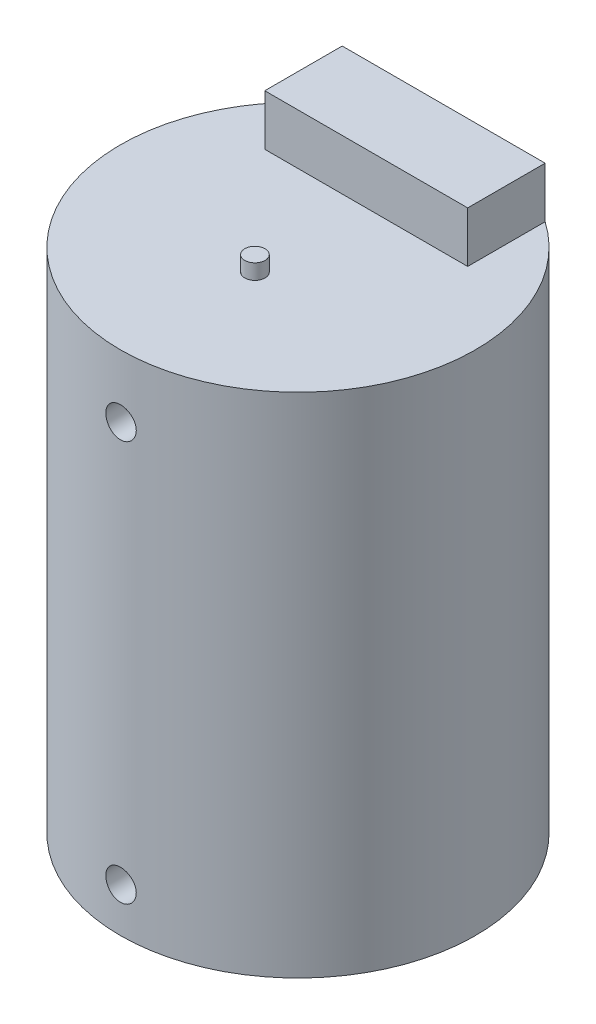
ISO-10303-21;
HEADER;
FILE_DESCRIPTION(('STEP AP214'),'2;1');
FILE_NAME('part.step','',(''),(''),'','','');
FILE_SCHEMA(('AUTOMOTIVE_DESIGN { 1 0 10303 214 1 1 1 1 }'));
ENDSEC;
DATA;
#1=APPLICATION_CONTEXT('core data for automotive mechanical design processes');
#2=APPLICATION_PROTOCOL_DEFINITION('international standard','automotive_design',2000,#1);
#3=PRODUCT_CONTEXT('',#1,'mechanical');
#4=PRODUCT('Part','Part','',(#3));
#5=PRODUCT_RELATED_PRODUCT_CATEGORY('part','',(#4));
#6=PRODUCT_DEFINITION_FORMATION('','',#4);
#7=PRODUCT_DEFINITION_CONTEXT('part definition',#1,'design');
#8=PRODUCT_DEFINITION('design','',#6,#7);
#9=PRODUCT_DEFINITION_SHAPE('','',#8);
#10=(LENGTH_UNIT() NAMED_UNIT(*) SI_UNIT(.MILLI.,.METRE.));
#11=(NAMED_UNIT(*) PLANE_ANGLE_UNIT() SI_UNIT($,.RADIAN.));
#12=(NAMED_UNIT(*) SI_UNIT($,.STERADIAN.) SOLID_ANGLE_UNIT());
#13=UNCERTAINTY_MEASURE_WITH_UNIT(LENGTH_MEASURE(1.E-05),#10,'distance_accuracy_value','');
#14=(GEOMETRIC_REPRESENTATION_CONTEXT(3) GLOBAL_UNCERTAINTY_ASSIGNED_CONTEXT((#13)) GLOBAL_UNIT_ASSIGNED_CONTEXT((#10,
#11,#12)) REPRESENTATION_CONTEXT('',''));
#15=CARTESIAN_POINT('',(0.,0.,0.));
#16=DIRECTION('',(0.,0.,1.));
#17=DIRECTION('',(1.,0.,0.));
#18=AXIS2_PLACEMENT_3D('',#15,#16,#17);
#19=CARTESIAN_POINT('',(0.,1000.,0.));
#20=DIRECTION('',(0.,-1.,0.));
#21=DIRECTION('',(0.,0.,-1.));
#22=AXIS2_PLACEMENT_3D('',#19,#20,#21);
#23=CYLINDRICAL_SURFACE('',#22,350.);
#24=CARTESIAN_POINT('',(0.,906.384704290411,-350.));
#25=CARTESIAN_POINT('',(-0.841199913410275,906.384711940687,-350.000001793461));
#26=CARTESIAN_POINT('',(-1.68228081727241,906.349309745664,-349.996961156668));
#27=CARTESIAN_POINT('',(-3.35872188095474,906.207959574055,-349.984887387734));
#28=CARTESIAN_POINT('',(-4.19408058226587,906.101994241818,-349.975852781323));
#29=CARTESIAN_POINT('',(-5.85370306744304,905.820115415634,-349.95203067925));
#30=CARTESIAN_POINT('',(-6.67795444488423,905.644129484846,-349.937237226361));
#31=CARTESIAN_POINT('',(-8.30858260341168,905.223503744461,-349.902318462871));
#32=CARTESIAN_POINT('',(-9.11496048346009,904.978868168531,-349.882193481074));
#33=CARTESIAN_POINT('',(-10.7037305189456,904.422858810472,-349.837192763907));
#34=CARTESIAN_POINT('',(-11.4861356447022,904.111521872471,-349.812319652107));
#35=CARTESIAN_POINT('',(-13.0219122184198,903.42425951082,-349.758517068482));
#36=CARTESIAN_POINT('',(-13.7752832433281,903.04833314648,-349.729587537579));
#37=CARTESIAN_POINT('',(-15.2475130217046,902.234666979692,-349.668494599527));
#38=CARTESIAN_POINT('',(-15.9663793833741,901.796940888625,-349.636331910166));
#39=CARTESIAN_POINT('',(-17.3647324181874,900.862717100991,-349.569672773772));
#40=CARTESIAN_POINT('',(-18.0442191553445,900.366219499964,-349.535176330533));
#41=CARTESIAN_POINT('',(-19.3606242063951,899.316702028603,-349.4647361845));
#42=CARTESIAN_POINT('',(-19.9974370716908,898.763550108479,-349.428789224597));
#43=CARTESIAN_POINT('',(-21.2222320650698,897.605616226898,-349.356541815104));
#44=CARTESIAN_POINT('',(-21.8102140763205,897.000834141917,-349.320241364667));
#45=CARTESIAN_POINT('',(-22.9332270166554,895.743872801275,-349.2483125219));
#46=CARTESIAN_POINT('',(-23.4682556315789,895.091691476339,-349.212684158995));
#47=CARTESIAN_POINT('',(-24.4815504032395,893.744545371233,-349.143110619879));
#48=CARTESIAN_POINT('',(-24.9598165458695,893.049580580431,-349.109165444087));
#49=CARTESIAN_POINT('',(-25.8568860593966,891.620654604419,-349.043871315844));
#50=CARTESIAN_POINT('',(-26.2755961666284,890.886634676287,-349.01252646676));
#51=CARTESIAN_POINT('',(-27.0496745734364,889.3857828399,-348.953386383225));
#52=CARTESIAN_POINT('',(-27.405042785414,888.618950886268,-348.925591153683));
#53=CARTESIAN_POINT('',(-28.0498728204073,887.057931041727,-348.874346031144));
#54=CARTESIAN_POINT('',(-28.3393356143937,886.263743554039,-348.850896074129));
#55=CARTESIAN_POINT('',(-28.8502636958614,884.653660253046,-348.809013717704));
#56=CARTESIAN_POINT('',(-29.0717291619425,883.837764496766,-348.790581305114));
#57=CARTESIAN_POINT('',(-29.4445880232377,882.192135305925,-348.759302662392));
#58=CARTESIAN_POINT('',(-29.5961534894901,881.362441117303,-348.746442719426));
#59=CARTESIAN_POINT('',(-29.8289156622466,879.693170231453,-348.726611352434));
#60=CARTESIAN_POINT('',(-29.9101124727588,878.853593548835,-348.719639919705));
#61=CARTESIAN_POINT('',(-30.0015438249033,877.170571500757,-348.711785698377));
#62=CARTESIAN_POINT('',(-30.0117796184041,876.327126203808,-348.710902802366));
#63=CARTESIAN_POINT('',(-29.9612173542216,874.642384012816,-348.715250732286));
#64=CARTESIAN_POINT('',(-29.9004193970092,873.801087115735,-348.72048154957));
#65=CARTESIAN_POINT('',(-29.708490064539,872.128883052538,-348.736884827069));
#66=CARTESIAN_POINT('',(-29.5775461330283,871.297954208555,-348.748041451698));
#67=CARTESIAN_POINT('',(-29.2463937561751,869.650113673708,-348.775968239673));
#68=CARTESIAN_POINT('',(-29.0461854530157,868.833201954075,-348.792738391496));
#69=CARTESIAN_POINT('',(-28.5779480019339,867.219172094084,-348.83141489132));
#70=CARTESIAN_POINT('',(-28.3099183522108,866.422054100227,-348.853321277323));
#71=CARTESIAN_POINT('',(-27.707963761812,864.853241717806,-348.901647808153));
#72=CARTESIAN_POINT('',(-27.3740386905616,864.081547379624,-348.928067961924));
#73=CARTESIAN_POINT('',(-26.6421957270373,862.568013947273,-348.984710556537));
#74=CARTESIAN_POINT('',(-26.2441941245026,861.826215516465,-349.01493795981));
#75=CARTESIAN_POINT('',(-25.3873452710109,860.37876701626,-349.078310925796));
#76=CARTESIAN_POINT('',(-24.928497985499,859.673116967391,-349.111456490167));
#77=CARTESIAN_POINT('',(-23.9531963073146,858.302901967346,-349.179729166371));
#78=CARTESIAN_POINT('',(-23.4367408728172,857.638337759531,-349.214856314035));
#79=CARTESIAN_POINT('',(-22.3498675798085,856.354963662294,-349.286100368498));
#80=CARTESIAN_POINT('',(-21.7794495990056,855.736153876569,-349.322217277539));
#81=CARTESIAN_POINT('',(-20.5867277411168,854.546703597345,-349.394540086001));
#82=CARTESIAN_POINT('',(-19.9642619254339,853.976225469493,-349.430745895162));
#83=CARTESIAN_POINT('',(-18.6734388842916,852.889718360417,-349.502103580482));
#84=CARTESIAN_POINT('',(-18.0050815534291,852.373689504258,-349.537255454219));
#85=CARTESIAN_POINT('',(-16.6271879362401,851.399740568169,-349.605509588307));
#86=CARTESIAN_POINT('',(-15.9176515634636,850.941820610237,-349.638611844355));
#87=CARTESIAN_POINT('',(-14.4624116506417,850.087354504673,-349.701828684513));
#88=CARTESIAN_POINT('',(-13.716708145804,849.690808297298,-349.731943271532));
#89=CARTESIAN_POINT('',(-12.1943210356077,848.961887830075,-349.788334180629));
#90=CARTESIAN_POINT('',(-11.4176337964918,848.629521124024,-349.814610050809));
#91=CARTESIAN_POINT('',(-9.83887628666652,848.031414129816,-349.862573212363));
#92=CARTESIAN_POINT('',(-9.03680600457015,847.76567387155,-349.884260501677));
#93=CARTESIAN_POINT('',(-7.41301230207026,847.302751375545,-349.922429576398));
#94=CARTESIAN_POINT('',(-6.59128923485133,847.105567906744,-349.938911455276));
#95=CARTESIAN_POINT('',(-4.93405067312473,846.78119008831,-349.966201070705));
#96=CARTESIAN_POINT('',(-4.09853521626514,846.653995547664,-349.97700882274));
#97=CARTESIAN_POINT('',(-2.42235697983446,846.470815858848,-349.992617641227));
#98=CARTESIAN_POINT('',(-1.5817188605505,846.414606610699,-349.99743761027));
#99=CARTESIAN_POINT('',(0.101318777040855,846.373067953901,-350.000996970546));
#100=CARTESIAN_POINT('',(0.943718291647613,846.387738396484,-349.999736374541));
#101=CARTESIAN_POINT('',(2.62426174116152,846.487851484196,-349.991170365327));
#102=CARTESIAN_POINT('',(3.46240571639218,846.573293457462,-349.983865009504));
#103=CARTESIAN_POINT('',(5.12847258966564,846.814326585707,-349.963416440986));
#104=CARTESIAN_POINT('',(5.95639548992016,846.969917725505,-349.950273229554));
#105=CARTESIAN_POINT('',(7.59488990063613,847.349831610202,-349.918544953997));
#106=CARTESIAN_POINT('',(8.40548574967378,847.574050095733,-349.899968146533));
#107=CARTESIAN_POINT('',(10.004882247193,848.089681444885,-349.857888794152));
#108=CARTESIAN_POINT('',(10.793682925518,848.381094216494,-349.83438625598));
#109=CARTESIAN_POINT('',(12.3439401699664,849.029029709522,-349.78311666837));
#110=CARTESIAN_POINT('',(13.1053963822713,849.385553273068,-349.755349563777));
#111=CARTESIAN_POINT('',(14.5956060330108,850.161167803377,-349.696331730358));
#112=CARTESIAN_POINT('',(15.3243593874082,850.58025893091,-349.665080992581));
#113=CARTESIAN_POINT('',(16.7458214834827,851.479155533843,-349.599892749469));
#114=CARTESIAN_POINT('',(17.4384361979897,851.959109231512,-349.5659487633));
#115=CARTESIAN_POINT('',(18.7808017187493,852.975512794641,-349.496399532427));
#116=CARTESIAN_POINT('',(19.4305524618253,853.511962743367,-349.460794285275));
#117=CARTESIAN_POINT('',(20.6826374341974,854.637584829538,-349.388926325706));
#118=CARTESIAN_POINT('',(21.2849708906156,855.226757826008,-349.352663602585));
#119=CARTESIAN_POINT('',(22.4379764154701,856.453675604912,-349.280504718872));
#120=CARTESIAN_POINT('',(22.9886484119782,857.09142045497,-349.24460855879));
#121=CARTESIAN_POINT('',(24.0358296873265,858.412743401274,-349.174104293275));
#122=CARTESIAN_POINT('',(24.5321924359537,859.096437831196,-349.139499830791));
#123=CARTESIAN_POINT('',(25.4655540329207,860.503325770607,-349.072663732725));
#124=CARTESIAN_POINT('',(25.902552760456,861.226519360473,-349.040432101972));
#125=CARTESIAN_POINT('',(26.7140594877123,862.707284223644,-348.979261112714));
#126=CARTESIAN_POINT('',(27.0885679600857,863.464855236877,-348.950321729308));
#127=CARTESIAN_POINT('',(27.7724053900736,865.009006363621,-348.896562338456));
#128=CARTESIAN_POINT('',(28.0817344785203,865.795586418899,-348.871742322741));
#129=CARTESIAN_POINT('',(28.6326124286313,867.391103858712,-348.826962602855));
#130=CARTESIAN_POINT('',(28.8742503588684,868.200010310804,-348.806996516464));
#131=CARTESIAN_POINT('',(29.2885362527958,869.835415320182,-348.772454337403));
#132=CARTESIAN_POINT('',(29.4611842565572,870.661913867249,-348.757878241602));
#133=CARTESIAN_POINT('',(29.7362297248896,872.326585864727,-348.734534747893));
#134=CARTESIAN_POINT('',(29.8386283870748,873.164759115858,-348.725767250959));
#135=CARTESIAN_POINT('',(29.9724308770422,874.846793886627,-348.714292675142));
#136=CARTESIAN_POINT('',(30.0038348679323,875.690655393191,-348.711585582335));
#137=CARTESIAN_POINT('',(29.9954324145485,877.37528815027,-348.712308420172));
#138=CARTESIAN_POINT('',(29.9558560240316,878.216060566008,-348.715718524441));
#139=CARTESIAN_POINT('',(29.8062278246191,879.891262782478,-348.728539702756));
#140=CARTESIAN_POINT('',(29.6961761782612,880.725692597834,-348.737950762962));
#141=CARTESIAN_POINT('',(29.4063968625408,882.382277776422,-348.762505050478));
#142=CARTESIAN_POINT('',(29.2266691881851,883.204433138776,-348.7776482782));
#143=CARTESIAN_POINT('',(28.7988383890201,884.830638559241,-348.813235026924));
#144=CARTESIAN_POINT('',(28.5507351967315,885.634688599485,-348.833678553157));
#145=CARTESIAN_POINT('',(27.98796040357,887.218940150905,-348.879282412759));
#146=CARTESIAN_POINT('',(27.6732935459536,887.99914335685,-348.904442410023));
#147=CARTESIAN_POINT('',(26.9796340722144,889.530263260386,-348.958765892848));
#148=CARTESIAN_POINT('',(26.6006414718834,890.281179965166,-348.987929377425));
#149=CARTESIAN_POINT('',(25.7810351212528,891.748439778466,-349.049433488844));
#150=CARTESIAN_POINT('',(25.3404224796728,892.46478350874,-349.081774058517));
#151=CARTESIAN_POINT('',(24.4006886432416,893.857894126794,-349.148719306151));
#152=CARTESIAN_POINT('',(23.9015673465035,894.534660945653,-349.183323988055));
#153=CARTESIAN_POINT('',(22.8466996725933,895.845910040029,-349.253931270241));
#154=CARTESIAN_POINT('',(22.2907828877654,896.480255019301,-349.289937864144));
#155=CARTESIAN_POINT('',(21.1275350503181,897.699896943251,-349.362228573084));
#156=CARTESIAN_POINT('',(20.520203701097,898.28519360494,-349.398512689721));
#157=CARTESIAN_POINT('',(19.2582493366437,899.402748722723,-349.470341011807));
#158=CARTESIAN_POINT('',(18.6036146647076,899.934994028243,-349.50588503208));
#159=CARTESIAN_POINT('',(17.251806270059,900.942509397321,-349.57521812377));
#160=CARTESIAN_POINT('',(16.5546331691663,901.417780293421,-349.609007220827));
#161=CARTESIAN_POINT('',(15.1212676393984,902.308838871909,-349.673937880398));
#162=CARTESIAN_POINT('',(14.3850025861138,902.724510126497,-349.705074213884));
#163=CARTESIAN_POINT('',(12.8798652664202,903.492321039424,-349.763743519245));
#164=CARTESIAN_POINT('',(12.1109909217642,903.844456640988,-349.791276260998));
#165=CARTESIAN_POINT('',(10.5469502359875,904.48228902022,-349.841925998307));
#166=CARTESIAN_POINT('',(9.75181251785509,904.768055567526,-349.865047626382));
#167=CARTESIAN_POINT('',(8.14041721750637,905.271485849149,-349.9062493807));
#168=CARTESIAN_POINT('',(7.32416497465223,905.489166621944,-349.924330768141));
#169=CARTESIAN_POINT('',(5.43420414991174,905.908605688939,-349.959432248569));
#170=CARTESIAN_POINT('',(4.35518839285609,906.086976546924,-349.97458631252));
#171=CARTESIAN_POINT('',(2.18404822413491,906.325020714026,-349.994869010008));
#172=CARTESIAN_POINT('',(1.09192384967217,906.38469435993,-349.999997671989));
#173=CARTESIAN_POINT('',(0.,906.384704290411,-350.));
#174=B_SPLINE_CURVE_WITH_KNOTS('',3,(#24,#25,#26,#27,#28,#29,#30,#31,#32,#33,#34,#35,#36,#37,
#38,#39,#40,#41,#42,#43,#44,#45,#46,#47,#48,#49,#50,#51,#52,#53,#54,#55,#56,#57,#58,#59,#60,#61,
#62,#63,#64,#65,#66,#67,#68,#69,#70,#71,#72,#73,#74,#75,#76,#77,#78,#79,#80,#81,#82,#83,#84,#85,
#86,#87,#88,#89,#90,#91,#92,#93,#94,#95,#96,#97,#98,#99,#100,#101,#102,#103,#104,#105,#106,#107,
#108,#109,#110,#111,#112,#113,#114,#115,#116,#117,#118,#119,#120,#121,#122,#123,#124,#125,#126,
#127,#128,#129,#130,#131,#132,#133,#134,#135,#136,#137,#138,#139,#140,#141,#142,#143,#144,#145,
#146,#147,#148,#149,#150,#151,#152,#153,#154,#155,#156,#157,#158,#159,#160,#161,#162,#163,#164,
#165,#166,#167,#168,#169,#170,#171,#172,#173),.UNSPECIFIED.,.T.,.F.,(4,2,2,2,2,2,2,2,2,2,2,2,2,
2,2,2,2,2,2,2,2,2,2,2,2,2,2,2,2,2,2,2,2,2,2,2,2,2,2,2,2,2,2,2,2,2,2,2,2,2,2,2,2,2,2,2,2,2,2,2,2,
2,2,2,2,2,2,2,2,2,2,2,2,2,4),(0.,2.5226451522737,5.04591100157414,7.57179400406629,
10.0975212679603,12.6218569652379,15.1462294304522,17.6700426958254,20.1938518585166,
22.723683492319,25.2535211788224,27.7834693751155,30.31341820018,32.8472862596904,
35.3811578233885,37.9149920536723,40.4488196286052,42.97637600684,45.5039286492255,
48.0314367013306,50.5589411785035,53.0797251167903,55.6005038805468,58.1213012957408,
60.6421037060569,63.1662264486994,65.6903506248249,68.2145204563278,70.7386960083213,
73.2710402679887,75.8033903441101,78.3357457367563,80.8680986642724,83.4007494631198,
85.9334013981521,88.4660078524806,90.9986073948802,93.5231913896997,96.0477700857558,
98.5723248152642,101.096878998479,103.617616731487,106.138351012764,108.659117898851,
111.179891262229,113.706925957013,116.233964376268,118.761043976444,121.288127095022,
123.821868546755,126.355615154523,128.889342597137,131.423064953845,133.953437588749,
136.483808753956,139.014136780203,141.544458993096,144.066595020347,146.5887252308,
149.110855621996,151.632988502269,154.15494171852,156.676894315631,159.198801541486,
161.72071315905,164.250426990014,166.780155415449,169.310509368308,171.840826341716,
174.376020837577,176.911377149327,179.444056012139,181.976100563517,185.250642295838,
188.525174737075),.UNSPECIFIED.);
#175=CARTESIAN_POINT('',(0.,906.384704290411,-350.));
#176=VERTEX_POINT('',#175);
#177=EDGE_CURVE('E49',#176,#176,#174,.T.);
#178=ORIENTED_EDGE('',*,*,#177,.T.);
#179=EDGE_LOOP('',(#178));
#180=FACE_BOUND('',#179,.T.);
#181=CARTESIAN_POINT('',(30.,876.384704290411,348.711915483254));
#182=CARTESIAN_POINT('',(30.0000076510266,875.54351076193,348.711913665531));
#183=CARTESIAN_POINT('',(29.9646059883911,874.702436241357,348.714965580547));
#184=CARTESIAN_POINT('',(29.823257994422,873.026008115229,348.727083137865));
#185=CARTESIAN_POINT('',(29.7172943067576,872.190655968308,348.73615025974));
#186=CARTESIAN_POINT('',(29.4354199802291,870.531046734321,348.760055029084));
#187=CARTESIAN_POINT('',(29.2594368959393,869.706802055632,348.77489865285));
#188=CARTESIAN_POINT('',(28.8388181814795,868.076187441062,348.809929706375));
#189=CARTESIAN_POINT('',(28.5941867845002,867.269816406312,348.830116806626));
#190=CARTESIAN_POINT('',(28.0381875193295,865.681060924347,348.875246639016));
#191=CARTESIAN_POINT('',(27.7268565797056,864.898663476899,348.90018673879));
#192=CARTESIAN_POINT('',(27.0396076687938,863.362901589693,348.95412068772));
#193=CARTESIAN_POINT('',(26.66368875679,862.609537572998,348.983114595919));
#194=CARTESIAN_POINT('',(25.8500386356234,861.137320544626,349.044326437602));
#195=CARTESIAN_POINT('',(25.4123211303076,860.418459929043,349.076543655857));
#196=CARTESIAN_POINT('',(24.4781152917236,859.020116774683,349.143295903023));
#197=CARTESIAN_POINT('',(23.9816270533532,858.340634172325,349.177830928191));
#198=CARTESIAN_POINT('',(22.9321188987618,857.024223284101,349.248328692025));
#199=CARTESIAN_POINT('',(22.3789659036336,856.387401264674,349.284294664401));
#200=CARTESIAN_POINT('',(21.22102793195,855.162587893537,349.356557660701));
#201=CARTESIAN_POINT('',(20.6162428313953,854.574596659106,349.392854685418));
#202=CARTESIAN_POINT('',(19.3592736349394,853.451565691128,349.464754621189));
#203=CARTESIAN_POINT('',(18.7070874812833,852.916528258775,349.500357502023));
#204=CARTESIAN_POINT('',(17.3599299368969,851.90321656351,349.569860898504));
#205=CARTESIAN_POINT('',(16.6649585362915,851.4249423137,349.603761413758));
#206=CARTESIAN_POINT('',(15.2360274344461,850.527863706953,349.6689515495));
#207=CARTESIAN_POINT('',(14.5020094941011,850.109151812121,349.70023708021));
#208=CARTESIAN_POINT('',(13.0011615146261,849.335069619805,349.759251085094));
#209=CARTESIAN_POINT('',(12.2343314303283,848.979699409517,349.786979554372));
#210=CARTESIAN_POINT('',(10.6733153969002,848.33486522743,349.838091263857));
#211=CARTESIAN_POINT('',(9.87912984680941,848.045400294725,349.861474567417));
#212=CARTESIAN_POINT('',(8.26905081508858,847.534467820525,349.9032312721));
#213=CARTESIAN_POINT('',(7.45315739026026,847.313000101125,349.921604686331));
#214=CARTESIAN_POINT('',(5.80753439238572,846.940136744289,349.952779798345));
#215=CARTESIAN_POINT('',(4.97784408513423,846.788568944515,349.965595180774));
#216=CARTESIAN_POINT('',(3.30858126442672,846.555801521669,349.985356782953));
#217=CARTESIAN_POINT('',(2.4690087655869,846.474601794532,349.992303011382));
#218=CARTESIAN_POINT('',(0.785994891933653,846.383163917898,350.000129055711));
#219=CARTESIAN_POINT('',(-0.0574464150400934,846.372924528834,350.001008977579));
#220=CARTESIAN_POINT('',(-1.74218109816265,846.423478951245,349.996677690608));
#221=CARTESIAN_POINT('',(-2.58347447730671,846.484272663612,349.991466490268));
#222=CARTESIAN_POINT('',(-4.25569607341954,846.676195723088,349.975122534414));
#223=CARTESIAN_POINT('',(-5.08664573548368,846.807139621044,349.964005392504));
#224=CARTESIAN_POINT('',(-6.73452800231841,847.138295518155,349.936173098302));
#225=CARTESIAN_POINT('',(-7.55146063562497,847.338507376277,349.919457957408));
#226=CARTESIAN_POINT('',(-9.1655317469463,847.806755521668,349.880900835024));
#227=CARTESIAN_POINT('',(-9.96267008335548,848.074792293994,349.859058816869));
#228=CARTESIAN_POINT('',(-11.5315221335286,848.676764659479,349.810863147014));
#229=CARTESIAN_POINT('',(-12.3032357975237,849.010700381627,349.784509486483));
#230=CARTESIAN_POINT('',(-13.8167936423736,849.742561879286,349.727995093124));
#231=CARTESIAN_POINT('',(-14.5585976688971,850.140570316737,349.697829453316));
#232=CARTESIAN_POINT('',(-16.0060561725992,850.997433716566,349.634567862548));
#233=CARTESIAN_POINT('',(-16.7117106295285,851.456288713026,349.601471909946));
#234=CARTESIAN_POINT('',(-18.0819329110188,852.431606294936,349.533280745397));
#235=CARTESIAN_POINT('',(-18.7464999909224,852.948069923995,349.498185497237));
#236=CARTESIAN_POINT('',(-20.0298780894956,854.034959645547,349.426983961533));
#237=CARTESIAN_POINT('',(-20.6486890046074,854.605385860164,349.390877671701));
#238=CARTESIAN_POINT('',(-21.83812965163,855.798113692654,349.318554241735));
#239=CARTESIAN_POINT('',(-22.4085978721979,856.420576390431,349.282337118915));
#240=CARTESIAN_POINT('',(-23.4950855528321,857.711391177628,349.210935467174));
#241=CARTESIAN_POINT('',(-24.0111048884114,858.37974337196,349.175750940615));
#242=CARTESIAN_POINT('',(-24.9850357222479,859.757625054394,349.107413834204));
#243=CARTESIAN_POINT('',(-25.4429470890495,860.467154635645,349.07426125895));
#244=CARTESIAN_POINT('',(-26.297397295017,861.922379636381,349.010931796331));
#245=CARTESIAN_POINT('',(-26.6939361928729,862.668075021279,348.980754906121));
#246=CARTESIAN_POINT('',(-27.4228508108733,864.190460081331,348.924233874169));
#247=CARTESIAN_POINT('',(-27.7552177130475,864.96715399837,348.897890259287));
#248=CARTESIAN_POINT('',(-28.3533241713093,866.545925463543,348.849794457492));
#249=CARTESIAN_POINT('',(-28.6190636968455,867.348003023316,348.828042272684));
#250=CARTESIAN_POINT('',(-29.0819836287596,868.971811716667,348.789753613807));
#251=CARTESIAN_POINT('',(-29.279165284323,869.793542491854,348.773217044704));
#252=CARTESIAN_POINT('',(-29.6035383006015,871.450796955555,348.745834464678));
#253=CARTESIAN_POINT('',(-29.7307298539368,872.286320606103,348.734988438093));
#254=CARTESIAN_POINT('',(-29.9139008559265,873.962502520029,348.719324063778));
#255=CARTESIAN_POINT('',(-29.9701054895797,874.803136003708,348.714486656292));
#256=CARTESIAN_POINT('',(-30.0116357229628,876.486164097442,348.710914889371));
#257=CARTESIAN_POINT('',(-29.996961472052,877.328558703782,348.712180517074));
#258=CARTESIAN_POINT('',(-29.8968416240305,879.009091837407,348.720778519626));
#259=CARTESIAN_POINT('',(-29.8113966990919,879.847230405038,348.728110836853));
#260=CARTESIAN_POINT('',(-29.5703586581433,881.513285828088,348.748632238291));
#261=CARTESIAN_POINT('',(-29.4147655575764,882.341202685757,348.761821321213));
#262=CARTESIAN_POINT('',(-29.0348524021441,883.979669358772,348.793654723958));
#263=CARTESIAN_POINT('',(-28.8106378687662,884.790243808696,348.812290665996));
#264=CARTESIAN_POINT('',(-28.2950181339948,886.389598023255,348.854495165542));
#265=CARTESIAN_POINT('',(-28.003613025399,887.178377817989,348.878063716239));
#266=CARTESIAN_POINT('',(-27.355696359124,888.728594689678,348.929464807542));
#267=CARTESIAN_POINT('',(-26.9991839442021,889.490031406459,348.95729740429));
#268=CARTESIAN_POINT('',(-26.2235949312178,890.980204035273,349.016438354291));
#269=CARTESIAN_POINT('',(-25.804518170773,891.708939862426,349.047746716564));
#270=CARTESIAN_POINT('',(-24.9056406142845,893.130389211511,349.113036911964));
#271=CARTESIAN_POINT('',(-24.4256899469466,893.823007662587,349.1470252623));
#272=CARTESIAN_POINT('',(-23.4092915431015,895.165381382167,349.216644000253));
#273=CARTESIAN_POINT('',(-22.8728437224928,895.815136586862,349.252274390312));
#274=CARTESIAN_POINT('',(-21.7472247927921,897.067231068197,349.324170594612));
#275=CARTESIAN_POINT('',(-21.1580528334501,897.669569579882,349.360436419092));
#276=CARTESIAN_POINT('',(-19.9311357884312,898.822585694114,349.432579128718));
#277=CARTESIAN_POINT('',(-19.2933906356909,899.373263225332,349.468456013328));
#278=CARTESIAN_POINT('',(-17.9720652841613,900.420456089223,349.538901456934));
#279=CARTESIAN_POINT('',(-17.2883687169083,900.916824852642,349.573466318647));
#280=CARTESIAN_POINT('',(-15.8814753322815,901.850198128793,349.640207350395));
#281=CARTESIAN_POINT('',(-15.1582784344544,902.287202520608,349.672383515565));
#282=CARTESIAN_POINT('',(-13.6775061862125,903.098719868245,349.733433965436));
#283=CARTESIAN_POINT('',(-12.9199310964778,903.473233297819,349.762308275167));
#284=CARTESIAN_POINT('',(-11.375771480968,904.157079725677,349.815935266091));
#285=CARTESIAN_POINT('',(-10.5891870135797,904.466412855141,349.840687955579));
#286=CARTESIAN_POINT('',(-8.99367255561559,905.017293855593,349.88533815207));
#287=CARTESIAN_POINT('',(-8.18477384109144,905.258931786122,349.905242105032));
#288=CARTESIAN_POINT('',(-6.54938503308946,905.673218840363,349.939672545544));
#289=CARTESIAN_POINT('',(-5.72289494996605,905.845868004681,349.95419903626));
#290=CARTESIAN_POINT('',(-4.05824014894473,906.120917174915,349.977461482329));
#291=CARTESIAN_POINT('',(-3.22007562711873,906.223318359196,349.986197534814));
#292=CARTESIAN_POINT('',(-1.53805838513294,906.357127336204,349.997630964618));
#293=CARTESIAN_POINT('',(-0.694205677895777,906.388535290162,350.000328355651));
#294=CARTESIAN_POINT('',(0.99043271796208,906.380142093171,349.999608970621));
#295=CARTESIAN_POINT('',(1.83121956067265,906.340569075798,349.996211782591));
#296=CARTESIAN_POINT('',(3.50645104599885,906.19094516149,349.983437401937));
#297=CARTESIAN_POINT('',(4.34089570314012,906.080894426021,349.974060223012));
#298=CARTESIAN_POINT('',(5.99751073514262,905.791114371009,349.949590865046));
#299=CARTESIAN_POINT('',(6.81968111110198,905.611385057699,349.934498686517));
#300=CARTESIAN_POINT('',(8.44591656919425,905.18354831578,349.899025465809));
#301=CARTESIAN_POINT('',(9.24998163369588,904.935440820586,349.878644418479));
#302=CARTESIAN_POINT('',(10.8342633792368,904.372654535431,349.833169903856));
#303=CARTESIAN_POINT('',(11.6144817371897,904.057980438853,349.808076768809));
#304=CARTESIAN_POINT('',(13.1456308447408,903.364303866217,349.75388390725));
#305=CARTESIAN_POINT('',(13.8965616014645,902.98530140581,349.724784181713));
#306=CARTESIAN_POINT('',(15.3638476802054,902.165673099194,349.663397338423));
#307=CARTESIAN_POINT('',(16.0802036280852,901.725048369017,349.631110278398));
#308=CARTESIAN_POINT('',(17.4733363670474,900.785288568592,349.564255805931));
#309=CARTESIAN_POINT('',(18.1501130898938,900.286153397476,349.529688389558));
#310=CARTESIAN_POINT('',(19.4613612921297,899.23127119927,349.459136270358));
#311=CARTESIAN_POINT('',(20.0956966900953,898.6753552789,349.423147546775));
#312=CARTESIAN_POINT('',(21.3153193765909,897.51211116181,349.350870107239));
#313=CARTESIAN_POINT('',(21.9006063828823,896.904782669287,349.31458138956));
#314=CARTESIAN_POINT('',(23.018142599517,895.642835900147,349.242721907863));
#315=CARTESIAN_POINT('',(23.5503786477371,894.988205957025,349.207151323753));
#316=CARTESIAN_POINT('',(24.5578762329083,893.63640883348,349.137746139062));
#317=CARTESIAN_POINT('',(25.0331386013504,892.939242274073,349.103911513148));
#318=CARTESIAN_POINT('',(25.924187443517,891.505881373384,349.038875403324));
#319=CARTESIAN_POINT('',(26.3398566554636,890.769613888843,349.007679159099));
#320=CARTESIAN_POINT('',(27.1076632247595,889.264471815675,348.948882969711));
#321=CARTESIAN_POINT('',(27.4597965245661,888.495595148424,348.921283254262));
#322=CARTESIAN_POINT('',(28.0976240780794,886.931549792257,348.870500171015));
#323=CARTESIAN_POINT('',(28.3833881151184,886.136409732077,348.847312169245));
#324=CARTESIAN_POINT('',(28.8868131998289,884.525009392131,348.805985709775));
#325=CARTESIAN_POINT('',(29.104491288365,883.708754452557,348.787845988694));
#326=CARTESIAN_POINT('',(29.5239187242483,881.818810122884,348.752628023088));
#327=CARTESIAN_POINT('',(29.7022830610704,880.739813996032,348.737420548622));
#328=CARTESIAN_POINT('',(29.9403185627114,878.568713145188,348.717065472901));
#329=CARTESIAN_POINT('',(29.9999900686494,877.476608458879,348.711917842734));
#330=CARTESIAN_POINT('',(30.,876.384704290411,348.711915483254));
#331=B_SPLINE_CURVE_WITH_KNOTS('',3,(#181,#182,#183,#184,#185,#186,#187,#188,#189,#190,#191,
#192,#193,#194,#195,#196,#197,#198,#199,#200,#201,#202,#203,#204,#205,#206,#207,#208,#209,#210,
#211,#212,#213,#214,#215,#216,#217,#218,#219,#220,#221,#222,#223,#224,#225,#226,#227,#228,#229,
#230,#231,#232,#233,#234,#235,#236,#237,#238,#239,#240,#241,#242,#243,#244,#245,#246,#247,#248,
#249,#250,#251,#252,#253,#254,#255,#256,#257,#258,#259,#260,#261,#262,#263,#264,#265,#266,#267,
#268,#269,#270,#271,#272,#273,#274,#275,#276,#277,#278,#279,#280,#281,#282,#283,#284,#285,#286,
#287,#288,#289,#290,#291,#292,#293,#294,#295,#296,#297,#298,#299,#300,#301,#302,#303,#304,#305,
#306,#307,#308,#309,#310,#311,#312,#313,#314,#315,#316,#317,#318,#319,#320,#321,#322,#323,#324,
#325,#326,#327,#328,#329,#330),.UNSPECIFIED.,.T.,.F.,(4,2,2,2,2,2,2,2,2,2,2,2,2,2,2,2,2,2,2,2,2,
2,2,2,2,2,2,2,2,2,2,2,2,2,2,2,2,2,2,2,2,2,2,2,2,2,2,2,2,2,2,2,2,2,2,2,2,2,2,2,2,2,2,2,2,2,2,2,2,
2,2,2,2,2,4),(0.,2.52262597879964,5.04587268399507,7.57173687853262,10.0974453501425,
12.6217590466071,15.1461095125139,17.6699010799994,20.1936885723507,22.7235453971013,
25.2534082977058,27.7833810893426,30.3133544649144,32.8472133797152,35.3810757826252,
37.9149012392243,40.4487200663653,42.9762643650486,45.5038049258527,48.0313013343039,
50.558794216277,53.0796381489296,55.6004769490199,58.1213337776411,60.6421955405468,
63.1663359901435,65.6904778536288,68.2146654506381,70.7388587603517,73.2711776428376,
75.803502314868,78.3358327155881,80.8681606946485,83.4008363974377,85.9335132615695,
88.4661439756558,90.9987677196393,93.5233371187251,96.0479011979283,98.5724412993788,
101.096980845055,103.617657662112,106.138330997851,108.659037524719,111.17975059406,
113.706794703504,116.233842574751,118.760931205501,121.288023325385,123.821775589918,
126.35553301533,128.889271231183,131.423004347687,133.953350483463,136.483695129897,
139.013997330377,141.54429378436,144.066472406103,146.58864524951,149.110817867268,
151.632992941056,154.154990244123,156.676986933603,159.198937953539,161.72089332128,
164.2505816342,166.78028450268,169.310613444931,171.840905454302,174.376109937462,
176.911476267079,179.444164617854,181.976218567558,185.250701364621,188.525174750921),.UNSPECIFIED.);
#332=CARTESIAN_POINT('',(30.,876.384704290411,348.711915483254));
#333=VERTEX_POINT('',#332);
#334=EDGE_CURVE('E129',#333,#333,#331,.T.);
#335=ORIENTED_EDGE('',*,*,#334,.T.);
#336=EDGE_LOOP('',(#335));
#337=FACE_BOUND('',#336,.T.);
#338=CARTESIAN_POINT('',(0.,1000.,0.));
#339=DIRECTION('',(0.,1.,0.));
#340=DIRECTION('',(0.,0.,1.));
#341=AXIS2_PLACEMENT_3D('',#338,#339,#340);
#342=CIRCLE('',#341,350.);
#343=CARTESIAN_POINT('',(200.,1000.,-287.228132326901));
#344=VERTEX_POINT('',#343);
#345=CARTESIAN_POINT('',(-200.,1000.,-287.228132326901));
#346=VERTEX_POINT('',#345);
#347=EDGE_CURVE('E126',#344,#346,#342,.T.);
#348=ORIENTED_EDGE('',*,*,#347,.F.);
#349=EDGE_CURVE('E130',#346,#344,#342,.T.);
#350=ORIENTED_EDGE('',*,*,#349,.F.);
#351=EDGE_LOOP('',(#348,#350));
#352=FACE_BOUND('',#351,.T.);
#353=CARTESIAN_POINT('',(0.,0.,0.));
#354=DIRECTION('',(0.,1.,0.));
#355=DIRECTION('',(0.,0.,1.));
#356=AXIS2_PLACEMENT_3D('',#353,#354,#355);
#357=CIRCLE('',#356,350.);
#358=CARTESIAN_POINT('',(0.,0.,350.));
#359=VERTEX_POINT('',#358);
#360=EDGE_CURVE('E123',#359,#359,#357,.T.);
#361=ORIENTED_EDGE('',*,*,#360,.T.);
#362=EDGE_LOOP('',(#361));
#363=FACE_BOUND('',#362,.T.);
#364=CARTESIAN_POINT('',(0.,56.8952769679863,350.));
#365=CARTESIAN_POINT('',(0.84119991341027,56.8952693177098,350.000001793461));
#366=CARTESIAN_POINT('',(1.6822808172724,56.9306715127329,349.996961156668));
#367=CARTESIAN_POINT('',(3.35872188095472,57.0720216843418,349.984887387734));
#368=CARTESIAN_POINT('',(4.19408058226585,57.1779870165791,349.975852781323));
#369=CARTESIAN_POINT('',(5.85370306744303,57.4598658427628,349.95203067925));
#370=CARTESIAN_POINT('',(6.67795444488422,57.6358517735506,349.937237226361));
#371=CARTESIAN_POINT('',(8.30858260341167,58.0564775139358,349.902318462871));
#372=CARTESIAN_POINT('',(9.11496048346008,58.3011130898658,349.882193481074));
#373=CARTESIAN_POINT('',(10.7037305189456,58.8571224479254,349.837192763907));
#374=CARTESIAN_POINT('',(11.4861356447022,59.1684593859264,349.812319652107));
#375=CARTESIAN_POINT('',(13.0219122184198,59.8557217475769,349.758517068482));
#376=CARTESIAN_POINT('',(13.7752832433281,60.2316481119168,349.729587537579));
#377=CARTESIAN_POINT('',(15.2475130217046,61.0453142787046,349.668494599527));
#378=CARTESIAN_POINT('',(15.9663793833741,61.4830403697716,349.636331910166));
#379=CARTESIAN_POINT('',(17.3647324181874,62.4172641574056,349.569672773772));
#380=CARTESIAN_POINT('',(18.0442191553445,62.9137617584331,349.535176330533));
#381=CARTESIAN_POINT('',(19.3606242063951,63.9632792297942,349.4647361845));
#382=CARTESIAN_POINT('',(19.9974370716908,64.5164311499175,349.428789224597));
#383=CARTESIAN_POINT('',(21.2222320650698,65.6743650314986,349.356541815103));
#384=CARTESIAN_POINT('',(21.8102140763204,66.2791471164796,349.320241364667));
#385=CARTESIAN_POINT('',(22.9332270166554,67.5361084571215,349.2483125219));
#386=CARTESIAN_POINT('',(23.4682556315789,68.1882897820581,349.212684158995));
#387=CARTESIAN_POINT('',(24.4815504032395,69.5354358871636,349.143110619879));
#388=CARTESIAN_POINT('',(24.9598165458694,70.2304006779655,349.109165444087));
#389=CARTESIAN_POINT('',(25.8568860593966,71.6593266539779,349.043871315844));
#390=CARTESIAN_POINT('',(26.2755961666283,72.3933465821096,349.01252646676));
#391=CARTESIAN_POINT('',(27.0496745734364,73.8941984184974,348.953386383225));
#392=CARTESIAN_POINT('',(27.405042785414,74.661030372129,348.925591153683));
#393=CARTESIAN_POINT('',(28.0498728204073,76.2220502166703,348.874346031144));
#394=CARTESIAN_POINT('',(28.3393356143937,77.0162377043582,348.850896074129));
#395=CARTESIAN_POINT('',(28.8502636958614,78.6263210053507,348.809013717704));
#396=CARTESIAN_POINT('',(29.0717291619425,79.4422167616309,348.790581305114));
#397=CARTESIAN_POINT('',(29.4445880232377,81.0878459524716,348.759302662392));
#398=CARTESIAN_POINT('',(29.5961534894901,81.9175401410943,348.746442719426));
#399=CARTESIAN_POINT('',(29.8289156622466,83.5868110269439,348.726611352434));
#400=CARTESIAN_POINT('',(29.9101124727588,84.4263877095623,348.719639919705));
#401=CARTESIAN_POINT('',(30.0015438249033,86.1094097576404,348.711785698377));
#402=CARTESIAN_POINT('',(30.0117796184041,86.9528550545888,348.710902802366));
#403=CARTESIAN_POINT('',(29.9612173542216,88.6375972455808,348.715250732286));
#404=CARTESIAN_POINT('',(29.9004193970092,89.4788941426615,348.72048154957));
#405=CARTESIAN_POINT('',(29.708490064539,91.1510982058594,348.736884827069));
#406=CARTESIAN_POINT('',(29.5775461330283,91.9820270498422,348.748041451698));
#407=CARTESIAN_POINT('',(29.2463937561751,93.6298675846887,348.775968239673));
#408=CARTESIAN_POINT('',(29.0461854530157,94.4467793043225,348.792738391496));
#409=CARTESIAN_POINT('',(28.5779480019339,96.0608091643127,348.83141489132));
#410=CARTESIAN_POINT('',(28.3099183522108,96.85792715817,348.853321277323));
#411=CARTESIAN_POINT('',(27.707963761812,98.426739540591,348.901647808153));
#412=CARTESIAN_POINT('',(27.3740386905617,99.1984338787729,348.928067961924));
#413=CARTESIAN_POINT('',(26.6421957270374,100.711967311124,348.984710556537));
#414=CARTESIAN_POINT('',(26.2441941245026,101.453765741932,349.01493795981));
#415=CARTESIAN_POINT('',(25.3873452710109,102.901214242137,349.078310925796));
#416=CARTESIAN_POINT('',(24.9284979854991,103.606864291005,349.111456490167));
#417=CARTESIAN_POINT('',(23.9531963073147,104.977079291051,349.179729166371));
#418=CARTESIAN_POINT('',(23.4367408728173,105.641643498866,349.214856314035));
#419=CARTESIAN_POINT('',(22.3498675798085,106.925017596102,349.286100368498));
#420=CARTESIAN_POINT('',(21.7794495990056,107.543827381828,349.322217277539));
#421=CARTESIAN_POINT('',(20.5867277411169,108.733277661052,349.394540086001));
#422=CARTESIAN_POINT('',(19.964261925434,109.303755788904,349.430745895163));
#423=CARTESIAN_POINT('',(18.6734388842917,110.39026289798,349.502103580482));
#424=CARTESIAN_POINT('',(18.0050815534292,110.906291754139,349.537255454219));
#425=CARTESIAN_POINT('',(16.6271879362401,111.880240690228,349.605509588307));
#426=CARTESIAN_POINT('',(15.9176515634636,112.33816064816,349.638611844355));
#427=CARTESIAN_POINT('',(14.4624116506417,113.192626753724,349.701828684513));
#428=CARTESIAN_POINT('',(13.716708145804,113.589172961099,349.731943271532));
#429=CARTESIAN_POINT('',(12.1943210356078,114.318093428322,349.788334180629));
#430=CARTESIAN_POINT('',(11.4176337964918,114.650460134373,349.814610050809));
#431=CARTESIAN_POINT('',(9.83887628666651,115.248567128581,349.862573212363));
#432=CARTESIAN_POINT('',(9.03680600457014,115.514307386847,349.884260501677));
#433=CARTESIAN_POINT('',(7.41301230207027,115.977229882852,349.922429576398));
#434=CARTESIAN_POINT('',(6.59128923485135,116.174413351653,349.938911455276));
#435=CARTESIAN_POINT('',(4.93405067312474,116.498791170087,349.966201070705));
#436=CARTESIAN_POINT('',(4.09853521626513,116.625985710733,349.97700882274));
#437=CARTESIAN_POINT('',(2.42235697983445,116.809165399549,349.992617641227));
#438=CARTESIAN_POINT('',(1.5817188605505,116.865374647698,349.99743761027));
#439=CARTESIAN_POINT('',(-0.101318777040854,116.906913304496,350.000996970546));
#440=CARTESIAN_POINT('',(-0.943718291647616,116.892242861913,349.999736374541));
#441=CARTESIAN_POINT('',(-2.62426174116152,116.792129774202,349.991170365327));
#442=CARTESIAN_POINT('',(-3.46240571639217,116.706687800935,349.983865009504));
#443=CARTESIAN_POINT('',(-5.12847258966563,116.46565467269,349.963416440986));
#444=CARTESIAN_POINT('',(-5.95639548992016,116.310063532892,349.950273229554));
#445=CARTESIAN_POINT('',(-7.59488990063613,115.930149648195,349.918544953997));
#446=CARTESIAN_POINT('',(-8.40548574967378,115.705931162664,349.899968146533));
#447=CARTESIAN_POINT('',(-10.004882247193,115.190299813512,349.857888794152));
#448=CARTESIAN_POINT('',(-10.793682925518,114.898887041903,349.83438625598));
#449=CARTESIAN_POINT('',(-12.3439401699664,114.250951548875,349.78311666837));
#450=CARTESIAN_POINT('',(-13.1053963822713,113.894427985329,349.755349563777));
#451=CARTESIAN_POINT('',(-14.5956060330108,113.11881345502,349.696331730358));
#452=CARTESIAN_POINT('',(-15.3243593874082,112.699722327487,349.665080992581));
#453=CARTESIAN_POINT('',(-16.7458214834827,111.800825724554,349.599892749469));
#454=CARTESIAN_POINT('',(-17.4384361979897,111.320872026885,349.5659487633));
#455=CARTESIAN_POINT('',(-18.7808017187492,110.304468463756,349.496399532427));
#456=CARTESIAN_POINT('',(-19.4305524618253,109.76801851503,349.460794285275));
#457=CARTESIAN_POINT('',(-20.6826374341973,108.642396428859,349.388926325706));
#458=CARTESIAN_POINT('',(-21.2849708906156,108.053223432389,349.352663602585));
#459=CARTESIAN_POINT('',(-22.4379764154701,106.826305653485,349.280504718872));
#460=CARTESIAN_POINT('',(-22.9886484119782,106.188560803427,349.24460855879));
#461=CARTESIAN_POINT('',(-24.0358296873265,104.867237857123,349.174104293275));
#462=CARTESIAN_POINT('',(-24.5321924359537,104.183543427201,349.139499830791));
#463=CARTESIAN_POINT('',(-25.4655540329208,102.77665548779,349.072663732725));
#464=CARTESIAN_POINT('',(-25.9025527604561,102.053461897924,349.040432101972));
#465=CARTESIAN_POINT('',(-26.7140594877124,100.572697034753,348.979261112714));
#466=CARTESIAN_POINT('',(-27.0885679600858,99.81512602152,348.950321729308));
#467=CARTESIAN_POINT('',(-27.7724053900736,98.2709748947763,348.896562338456));
#468=CARTESIAN_POINT('',(-28.0817344785203,97.4843948394979,348.871742322741));
#469=CARTESIAN_POINT('',(-28.6326124286314,95.8888773996855,348.826962602855));
#470=CARTESIAN_POINT('',(-28.8742503588684,95.0799709475925,348.806996516464));
#471=CARTESIAN_POINT('',(-29.2885362527958,93.4445659382147,348.772454337403));
#472=CARTESIAN_POINT('',(-29.4611842565572,92.618067391148,348.757878241602));
#473=CARTESIAN_POINT('',(-29.7362297248896,90.9533953936702,348.734534747893));
#474=CARTESIAN_POINT('',(-29.8386283870748,90.1152221425385,348.725767250959));
#475=CARTESIAN_POINT('',(-29.9724308770422,88.4331873717699,348.714292675142));
#476=CARTESIAN_POINT('',(-30.0038348679323,87.589325865206,348.711585582335));
#477=CARTESIAN_POINT('',(-29.9954324145485,85.9046931081267,348.712308420172));
#478=CARTESIAN_POINT('',(-29.9558560240316,85.063920692389,348.715718524441));
#479=CARTESIAN_POINT('',(-29.8062278246191,83.3887184759191,348.728539702756));
#480=CARTESIAN_POINT('',(-29.6961761782612,82.5542886605634,348.737950762962));
#481=CARTESIAN_POINT('',(-29.4063968625408,80.8977034819746,348.762505050478));
#482=CARTESIAN_POINT('',(-29.2266691881851,80.0755481196213,348.7776482782));
#483=CARTESIAN_POINT('',(-28.7988383890201,78.4493426991557,348.813235026924));
#484=CARTESIAN_POINT('',(-28.5507351967315,77.6452926589124,348.833678553157));
#485=CARTESIAN_POINT('',(-27.98796040357,76.0610411074921,348.879282412759));
#486=CARTESIAN_POINT('',(-27.6732935459536,75.2808379015465,348.904442410023));
#487=CARTESIAN_POINT('',(-26.9796340722143,73.7497179980107,348.958765892848));
#488=CARTESIAN_POINT('',(-26.6006414718834,72.9988012932307,348.987929377425));
#489=CARTESIAN_POINT('',(-25.7810351212528,71.5315414799312,349.049433488844));
#490=CARTESIAN_POINT('',(-25.3404224796728,70.8151977496576,349.081774058517));
#491=CARTESIAN_POINT('',(-24.4006886432416,69.422087131603,349.148719306151));
#492=CARTESIAN_POINT('',(-23.9015673465035,68.7453203127443,349.183323988055));
#493=CARTESIAN_POINT('',(-22.8466996725932,67.4340712183678,349.253931270241));
#494=CARTESIAN_POINT('',(-22.2907828877654,66.799726239096,349.289937864144));
#495=CARTESIAN_POINT('',(-21.127535050318,65.5800843151457,349.362228573084));
#496=CARTESIAN_POINT('',(-20.5202037010969,64.9947876534573,349.398512689721));
#497=CARTESIAN_POINT('',(-19.2582493366437,63.8772325356741,349.470341011807));
#498=CARTESIAN_POINT('',(-18.6036146647076,63.3449872301539,349.50588503208));
#499=CARTESIAN_POINT('',(-17.251806270059,62.3374718610759,349.57521812377));
#500=CARTESIAN_POINT('',(-16.5546331691663,61.8622009649761,349.609007220827));
#501=CARTESIAN_POINT('',(-15.1212676393984,60.9711423864876,349.673937880398));
#502=CARTESIAN_POINT('',(-14.3850025861137,60.5554711319002,349.705074213884));
#503=CARTESIAN_POINT('',(-12.8798652664202,59.7876602189732,349.763743519245));
#504=CARTESIAN_POINT('',(-12.1109909217641,59.4355246174092,349.791276260998));
#505=CARTESIAN_POINT('',(-10.5469502359874,58.7976922381774,349.841925998307));
#506=CARTESIAN_POINT('',(-9.75181251785508,58.5119256908712,349.865047626382));
#507=CARTESIAN_POINT('',(-8.14041721750635,58.0084954092482,349.9062493807));
#508=CARTESIAN_POINT('',(-7.3241649746522,57.7908146364526,349.924330768141));
#509=CARTESIAN_POINT('',(-5.43420414991171,57.3713755694579,349.959432248569));
#510=CARTESIAN_POINT('',(-4.35518839285608,57.1930047114726,349.97458631252));
#511=CARTESIAN_POINT('',(-2.18404822413491,56.9549605443707,349.994869010008));
#512=CARTESIAN_POINT('',(-1.09192384967217,56.8952868984667,349.999997671989));
#513=CARTESIAN_POINT('',(0.,56.8952769679863,350.));
#514=B_SPLINE_CURVE_WITH_KNOTS('',3,(#364,#365,#366,#367,#368,#369,#370,#371,#372,#373,#374,
#375,#376,#377,#378,#379,#380,#381,#382,#383,#384,#385,#386,#387,#388,#389,#390,#391,#392,#393,
#394,#395,#396,#397,#398,#399,#400,#401,#402,#403,#404,#405,#406,#407,#408,#409,#410,#411,#412,
#413,#414,#415,#416,#417,#418,#419,#420,#421,#422,#423,#424,#425,#426,#427,#428,#429,#430,#431,
#432,#433,#434,#435,#436,#437,#438,#439,#440,#441,#442,#443,#444,#445,#446,#447,#448,#449,#450,
#451,#452,#453,#454,#455,#456,#457,#458,#459,#460,#461,#462,#463,#464,#465,#466,#467,#468,#469,
#470,#471,#472,#473,#474,#475,#476,#477,#478,#479,#480,#481,#482,#483,#484,#485,#486,#487,#488,
#489,#490,#491,#492,#493,#494,#495,#496,#497,#498,#499,#500,#501,#502,#503,#504,#505,#506,#507,
#508,#509,#510,#511,#512,#513),.UNSPECIFIED.,.T.,.F.,(4,2,2,2,2,2,2,2,2,2,2,2,2,2,2,2,2,2,2,2,2,
2,2,2,2,2,2,2,2,2,2,2,2,2,2,2,2,2,2,2,2,2,2,2,2,2,2,2,2,2,2,2,2,2,2,2,2,2,2,2,2,2,2,2,2,2,2,2,2,
2,2,2,2,2,4),(0.,2.52264515227369,5.04591100157411,7.5717940040663,10.0975212679603,
12.6218569652378,15.1462294304522,17.6700426958254,20.1938518585166,22.723683492319,
25.2535211788224,27.7834693751156,30.3134182001799,32.8472862596904,35.3811578233884,
37.9149920536723,40.4488196286052,42.97637600684,45.5039286492255,48.0314367013305,
50.5589411785035,53.0797251167903,55.6005038805469,58.1213012957408,60.6421037060568,
63.1662264486993,65.6903506248247,68.2145204563276,70.7386960083212,73.2710402679885,
75.8033903441101,78.3357457367562,80.8680986642724,83.4007494631198,85.933401398152,
88.4660078524805,90.9986073948802,93.5231913896997,96.0477700857557,98.5723248152642,
101.096878998479,103.617616731487,106.138351012764,108.659117898851,111.179891262229,
113.706925957013,116.233964376268,118.761043976444,121.288127095022,123.821868546755,
126.355615154523,128.889342597137,131.423064953845,133.953437588749,136.483808753956,
139.014136780203,141.544458993096,144.066595020347,146.5887252308,149.110855621996,
151.632988502269,154.15494171852,156.676894315631,159.198801541486,161.72071315905,
164.250426990014,166.780155415449,169.310509368308,171.840826341716,174.376020837577,
176.911377149327,179.444056012139,181.976100563517,185.250642295838,188.525174737075),.UNSPECIFIED.);
#515=CARTESIAN_POINT('',(0.,56.8952769679863,350.));
#516=VERTEX_POINT('',#515);
#517=EDGE_CURVE('E11',#516,#516,#514,.T.);
#518=ORIENTED_EDGE('',*,*,#517,.F.);
#519=EDGE_LOOP('',(#518));
#520=FACE_BOUND('',#519,.T.);
#521=ADVANCED_FACE('F37',(#180,#337,#352,#363,#520),#23,.T.);
#522=CARTESIAN_POINT('',(0.,1000.,0.));
#523=DIRECTION('',(0.,1.,0.));
#524=DIRECTION('',(0.,0.,1.));
#525=AXIS2_PLACEMENT_3D('',#522,#523,#524);
#526=PLANE('',#525);
#527=CARTESIAN_POINT('',(0.,1000.,84.8410881424102));
#528=DIRECTION('',(0.,1.,0.));
#529=DIRECTION('',(0.,0.,1.));
#530=AXIS2_PLACEMENT_3D('',#527,#528,#529);
#531=CIRCLE('',#530,20.);
#532=CARTESIAN_POINT('',(0.,1000.,104.84108814241));
#533=VERTEX_POINT('',#532);
#534=EDGE_CURVE('E119',#533,#533,#531,.T.);
#535=ORIENTED_EDGE('',*,*,#534,.F.);
#536=EDGE_LOOP('',(#535));
#537=FACE_BOUND('',#536,.T.);
#538=DIRECTION('',(0.,0.,-1.));
#539=VECTOR('',#538,1.);
#540=CARTESIAN_POINT('',(200.,1000.,-287.228132326901));
#541=LINE('',#540,#539);
#542=CARTESIAN_POINT('',(200.,1000.,-134.555021266026));
#543=VERTEX_POINT('',#542);
#544=EDGE_CURVE('E98',#543,#344,#541,.T.);
#545=ORIENTED_EDGE('',*,*,#544,.F.);
#546=DIRECTION('',(1.,0.,0.));
#547=VECTOR('',#546,1.);
#548=CARTESIAN_POINT('',(0.,1000.,-134.555021266026));
#549=LINE('',#548,#547);
#550=CARTESIAN_POINT('',(-200.,1000.,-134.555021266026));
#551=VERTEX_POINT('',#550);
#552=EDGE_CURVE('E109',#551,#543,#549,.T.);
#553=ORIENTED_EDGE('',*,*,#552,.F.);
#554=DIRECTION('',(0.,0.,1.));
#555=VECTOR('',#554,1.);
#556=CARTESIAN_POINT('',(-200.,1000.,-134.555021266026));
#557=LINE('',#556,#555);
#558=EDGE_CURVE('E78',#346,#551,#557,.T.);
#559=ORIENTED_EDGE('',*,*,#558,.F.);
#560=ORIENTED_EDGE('',*,*,#349,.T.);
#561=EDGE_LOOP('',(#545,#553,#559,#560));
#562=FACE_BOUND('',#561,.T.);
#563=ADVANCED_FACE('F172',(#537,#562),#526,.T.);
#564=ORIENTED_EDGE('',*,*,#347,.T.);
#565=DIRECTION('',(-1.,0.,0.));
#566=VECTOR('',#565,1.);
#567=CARTESIAN_POINT('',(-200.,1000.,-287.228132326901));
#568=LINE('',#567,#566);
#569=EDGE_CURVE('E113',#344,#346,#568,.T.);
#570=ORIENTED_EDGE('',*,*,#569,.F.);
#571=EDGE_LOOP('',(#564,#570));
#572=FACE_BOUND('',#571,.T.);
#573=ADVANCED_FACE('F174',(#572),#526,.T.);
#574=CARTESIAN_POINT('',(0.,0.,0.));
#575=DIRECTION('',(0.,1.,0.));
#576=DIRECTION('',(0.,0.,1.));
#577=AXIS2_PLACEMENT_3D('',#574,#575,#576);
#578=PLANE('',#577);
#579=ORIENTED_EDGE('',*,*,#360,.F.);
#580=EDGE_LOOP('',(#579));
#581=FACE_BOUND('',#580,.T.);
#582=ADVANCED_FACE('F170',(#581),#578,.F.);
#583=CARTESIAN_POINT('',(0.,1030.,84.8410881424102));
#584=DIRECTION('',(0.,-1.,0.));
#585=DIRECTION('',(0.,0.,-1.));
#586=AXIS2_PLACEMENT_3D('',#583,#584,#585);
#587=CYLINDRICAL_SURFACE('',#586,20.);
#588=CARTESIAN_POINT('',(0.,1030.,84.8410881424102));
#589=DIRECTION('',(0.,1.,0.));
#590=DIRECTION('',(0.,0.,1.));
#591=AXIS2_PLACEMENT_3D('',#588,#589,#590);
#592=CIRCLE('',#591,20.);
#593=CARTESIAN_POINT('',(0.,1030.,104.84108814241));
#594=VERTEX_POINT('',#593);
#595=EDGE_CURVE('E120',#594,#594,#592,.T.);
#596=ORIENTED_EDGE('',*,*,#595,.F.);
#597=EDGE_LOOP('',(#596));
#598=FACE_BOUND('',#597,.T.);
#599=ORIENTED_EDGE('',*,*,#534,.T.);
#600=EDGE_LOOP('',(#599));
#601=FACE_BOUND('',#600,.T.);
#602=ADVANCED_FACE('F166',(#598,#601),#587,.T.);
#603=CARTESIAN_POINT('',(0.,1030.,84.8410881424102));
#604=DIRECTION('',(0.,1.,0.));
#605=DIRECTION('',(0.,0.,1.));
#606=AXIS2_PLACEMENT_3D('',#603,#604,#605);
#607=PLANE('',#606);
#608=ORIENTED_EDGE('',*,*,#595,.T.);
#609=EDGE_LOOP('',(#608));
#610=FACE_BOUND('',#609,.T.);
#611=ADVANCED_FACE('F162',(#610),#607,.T.);
#612=CARTESIAN_POINT('',(0.,1100.,-134.555021266026));
#613=DIRECTION('',(0.,0.,-1.));
#614=DIRECTION('',(-1.,0.,0.));
#615=AXIS2_PLACEMENT_3D('',#612,#613,#614);
#616=PLANE('',#615);
#617=ORIENTED_EDGE('',*,*,#552,.T.);
#618=DIRECTION('',(0.,-1.,0.));
#619=VECTOR('',#618,1.);
#620=CARTESIAN_POINT('',(200.,1100.,-134.555021266026));
#621=LINE('',#620,#619);
#622=CARTESIAN_POINT('',(200.,1100.,-134.555021266026));
#623=VERTEX_POINT('',#622);
#624=EDGE_CURVE('E101',#623,#543,#621,.T.);
#625=ORIENTED_EDGE('',*,*,#624,.F.);
#626=DIRECTION('',(1.,0.,0.));
#627=VECTOR('',#626,1.);
#628=CARTESIAN_POINT('',(0.,1100.,-134.555021266026));
#629=LINE('',#628,#627);
#630=CARTESIAN_POINT('',(-200.,1100.,-134.555021266026));
#631=VERTEX_POINT('',#630);
#632=EDGE_CURVE('E83',#631,#623,#629,.T.);
#633=ORIENTED_EDGE('',*,*,#632,.F.);
#634=DIRECTION('',(0.,-1.,0.));
#635=VECTOR('',#634,1.);
#636=CARTESIAN_POINT('',(-200.,1100.,-134.555021266026));
#637=LINE('',#636,#635);
#638=EDGE_CURVE('E105',#631,#551,#637,.T.);
#639=ORIENTED_EDGE('',*,*,#638,.T.);
#640=EDGE_LOOP('',(#617,#625,#633,#639));
#641=FACE_BOUND('',#640,.T.);
#642=ADVANCED_FACE('F159',(#641),#616,.F.);
#643=CARTESIAN_POINT('',(200.,1100.,-287.228132326901));
#644=DIRECTION('',(-1.,0.,0.));
#645=DIRECTION('',(0.,0.,1.));
#646=AXIS2_PLACEMENT_3D('',#643,#644,#645);
#647=PLANE('',#646);
#648=ORIENTED_EDGE('',*,*,#544,.T.);
#649=DIRECTION('',(0.,-1.,0.));
#650=VECTOR('',#649,1.);
#651=CARTESIAN_POINT('',(200.,1100.,-287.228132326901));
#652=LINE('',#651,#650);
#653=CARTESIAN_POINT('',(200.,1100.,-287.228132326901));
#654=VERTEX_POINT('',#653);
#655=EDGE_CURVE('E95',#654,#344,#652,.T.);
#656=ORIENTED_EDGE('',*,*,#655,.F.);
#657=DIRECTION('',(0.,0.,-1.));
#658=VECTOR('',#657,1.);
#659=CARTESIAN_POINT('',(200.,1100.,-287.228132326901));
#660=LINE('',#659,#658);
#661=EDGE_CURVE('E86',#623,#654,#660,.T.);
#662=ORIENTED_EDGE('',*,*,#661,.F.);
#663=ORIENTED_EDGE('',*,*,#624,.T.);
#664=EDGE_LOOP('',(#648,#656,#662,#663));
#665=FACE_BOUND('',#664,.T.);
#666=ADVANCED_FACE('F96',(#665),#647,.F.);
#667=CARTESIAN_POINT('',(-200.,1100.,-287.228132326901));
#668=DIRECTION('',(0.,0.,1.));
#669=DIRECTION('',(1.,0.,0.));
#670=AXIS2_PLACEMENT_3D('',#667,#668,#669);
#671=PLANE('',#670);
#672=ORIENTED_EDGE('',*,*,#569,.T.);
#673=DIRECTION('',(0.,-1.,0.));
#674=VECTOR('',#673,1.);
#675=CARTESIAN_POINT('',(-200.,1100.,-287.228132326901));
#676=LINE('',#675,#674);
#677=CARTESIAN_POINT('',(-200.,1100.,-287.228132326901));
#678=VERTEX_POINT('',#677);
#679=EDGE_CURVE('E56',#678,#346,#676,.T.);
#680=ORIENTED_EDGE('',*,*,#679,.F.);
#681=DIRECTION('',(-1.,0.,0.));
#682=VECTOR('',#681,1.);
#683=CARTESIAN_POINT('',(-200.,1100.,-287.228132326901));
#684=LINE('',#683,#682);
#685=EDGE_CURVE('E90',#654,#678,#684,.T.);
#686=ORIENTED_EDGE('',*,*,#685,.F.);
#687=ORIENTED_EDGE('',*,*,#655,.T.);
#688=EDGE_LOOP('',(#672,#680,#686,#687));
#689=FACE_BOUND('',#688,.T.);
#690=ADVANCED_FACE('F103',(#689),#671,.F.);
#691=CARTESIAN_POINT('',(-200.,1100.,-134.555021266026));
#692=DIRECTION('',(1.,0.,0.));
#693=DIRECTION('',(0.,0.,-1.));
#694=AXIS2_PLACEMENT_3D('',#691,#692,#693);
#695=PLANE('',#694);
#696=ORIENTED_EDGE('',*,*,#558,.T.);
#697=ORIENTED_EDGE('',*,*,#638,.F.);
#698=DIRECTION('',(0.,0.,1.));
#699=VECTOR('',#698,1.);
#700=CARTESIAN_POINT('',(-200.,1100.,-134.555021266026));
#701=LINE('',#700,#699);
#702=EDGE_CURVE('E64',#678,#631,#701,.T.);
#703=ORIENTED_EDGE('',*,*,#702,.F.);
#704=ORIENTED_EDGE('',*,*,#679,.T.);
#705=EDGE_LOOP('',(#696,#697,#703,#704));
#706=FACE_BOUND('',#705,.T.);
#707=ADVANCED_FACE('F152',(#706),#695,.F.);
#708=CARTESIAN_POINT('',(0.,1100.,0.));
#709=DIRECTION('',(0.,-1.,0.));
#710=DIRECTION('',(0.,0.,-1.));
#711=AXIS2_PLACEMENT_3D('',#708,#709,#710);
#712=PLANE('',#711);
#713=ORIENTED_EDGE('',*,*,#632,.T.);
#714=ORIENTED_EDGE('',*,*,#661,.T.);
#715=ORIENTED_EDGE('',*,*,#685,.T.);
#716=ORIENTED_EDGE('',*,*,#702,.T.);
#717=EDGE_LOOP('',(#713,#714,#715,#716));
#718=FACE_BOUND('',#717,.T.);
#719=ADVANCED_FACE('F88',(#718),#712,.F.);
#720=CARTESIAN_POINT('',(0.,876.384704290411,-350.));
#721=DIRECTION('',(0.,0.,1.));
#722=DIRECTION('',(1.,0.,0.));
#723=AXIS2_PLACEMENT_3D('',#720,#721,#722);
#724=CYLINDRICAL_SURFACE('',#723,30.);
#725=ORIENTED_EDGE('',*,*,#334,.F.);
#726=EDGE_LOOP('',(#725));
#727=FACE_BOUND('',#726,.T.);
#728=ORIENTED_EDGE('',*,*,#177,.F.);
#729=EDGE_LOOP('',(#728));
#730=FACE_BOUND('',#729,.T.);
#731=ADVANCED_FACE('F141',(#727,#730),#724,.F.);
#732=CARTESIAN_POINT('',(0.,86.8952769679863,350.));
#733=DIRECTION('',(0.,0.,-1.));
#734=DIRECTION('',(-1.,0.,0.));
#735=AXIS2_PLACEMENT_3D('',#732,#733,#734);
#736=CYLINDRICAL_SURFACE('',#735,30.);
#737=CARTESIAN_POINT('',(0.,86.8952769679863,-29.));
#738=DIRECTION('',(0.,0.,1.));
#739=DIRECTION('',(1.,0.,0.));
#740=AXIS2_PLACEMENT_3D('',#737,#738,#739);
#741=CIRCLE('',#740,30.);
#742=CARTESIAN_POINT('',(30.,86.8952769679863,-29.));
#743=VERTEX_POINT('',#742);
#744=EDGE_CURVE('E111',#743,#743,#741,.T.);
#745=ORIENTED_EDGE('',*,*,#744,.F.);
#746=EDGE_LOOP('',(#745));
#747=FACE_BOUND('',#746,.T.);
#748=ORIENTED_EDGE('',*,*,#517,.T.);
#749=EDGE_LOOP('',(#748));
#750=FACE_BOUND('',#749,.T.);
#751=ADVANCED_FACE('F145',(#747,#750),#736,.F.);
#752=CARTESIAN_POINT('',(0.,86.8952769679863,-29.));
#753=DIRECTION('',(0.,0.,1.));
#754=DIRECTION('',(1.,0.,0.));
#755=AXIS2_PLACEMENT_3D('',#752,#753,#754);
#756=PLANE('',#755);
#757=ORIENTED_EDGE('',*,*,#744,.T.);
#758=EDGE_LOOP('',(#757));
#759=FACE_BOUND('',#758,.T.);
#760=ADVANCED_FACE('F199',(#759),#756,.T.);
#761=CLOSED_SHELL('',(#521,#563,#573,#582,#602,#611,#642,#666,#690,#707,#719,#731,#751,#760));
#762=MANIFOLD_SOLID_BREP('B2',#761);
#763=ADVANCED_BREP_SHAPE_REPRESENTATION('',(#18,#762),#14);
#764=SHAPE_DEFINITION_REPRESENTATION(#9,#763);
ENDSEC;
END-ISO-10303-21;
